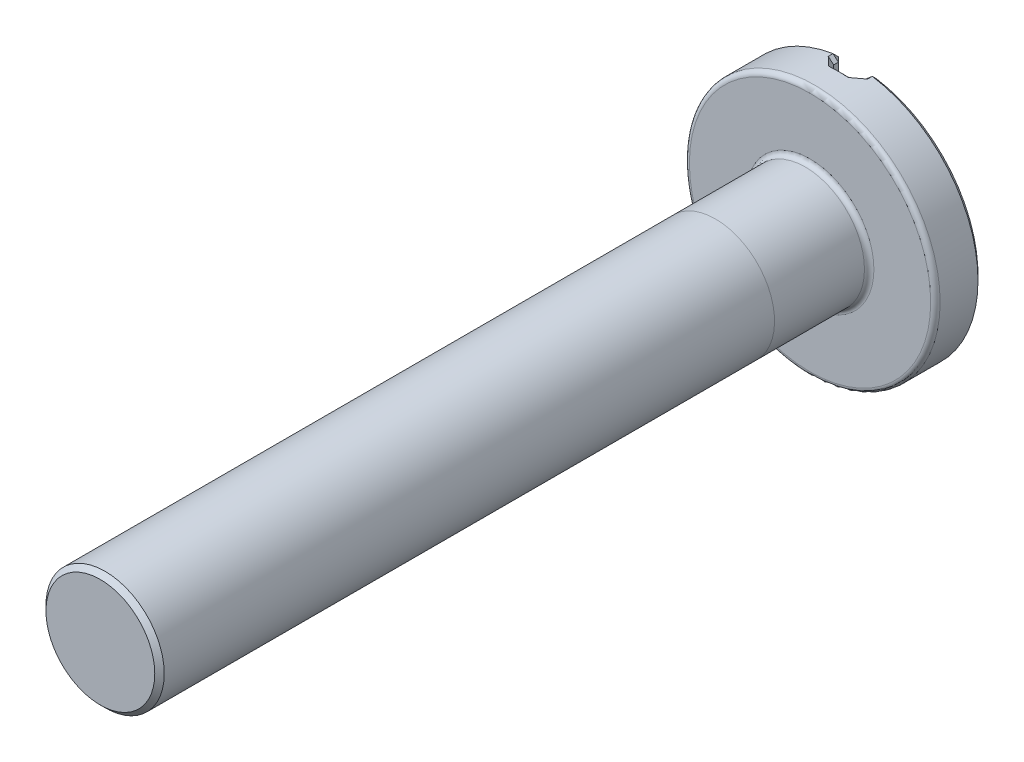
ISO-10303-21;
HEADER;
FILE_DESCRIPTION(('STEP AP214'),'2;1');
FILE_NAME('part.step','',(''),(''),'','','');
FILE_SCHEMA(('AUTOMOTIVE_DESIGN { 1 0 10303 214 1 1 1 1 }'));
ENDSEC;
DATA;
#1=APPLICATION_CONTEXT('core data for automotive mechanical design processes');
#2=APPLICATION_PROTOCOL_DEFINITION('international standard','automotive_design',2000,#1);
#3=PRODUCT_CONTEXT('',#1,'mechanical');
#4=PRODUCT('Part','Part','',(#3));
#5=PRODUCT_RELATED_PRODUCT_CATEGORY('part','',(#4));
#6=PRODUCT_DEFINITION_FORMATION('','',#4);
#7=PRODUCT_DEFINITION_CONTEXT('part definition',#1,'design');
#8=PRODUCT_DEFINITION('design','',#6,#7);
#9=PRODUCT_DEFINITION_SHAPE('','',#8);
#10=(LENGTH_UNIT() NAMED_UNIT(*) SI_UNIT(.MILLI.,.METRE.));
#11=(NAMED_UNIT(*) PLANE_ANGLE_UNIT() SI_UNIT($,.RADIAN.));
#12=(NAMED_UNIT(*) SI_UNIT($,.STERADIAN.) SOLID_ANGLE_UNIT());
#13=UNCERTAINTY_MEASURE_WITH_UNIT(LENGTH_MEASURE(1.E-05),#10,'distance_accuracy_value','');
#14=(GEOMETRIC_REPRESENTATION_CONTEXT(3) GLOBAL_UNCERTAINTY_ASSIGNED_CONTEXT((#13)) GLOBAL_UNIT_ASSIGNED_CONTEXT((#10,
#11,#12)) REPRESENTATION_CONTEXT('',''));
#15=CARTESIAN_POINT('',(0.,0.,0.));
#16=DIRECTION('',(0.,0.,1.));
#17=DIRECTION('',(1.,0.,0.));
#18=AXIS2_PLACEMENT_3D('',#15,#16,#17);
#19=CARTESIAN_POINT('',(0.,0.,7.5));
#20=DIRECTION('',(0.,0.,-1.));
#21=DIRECTION('',(-1.,0.,0.));
#22=AXIS2_PLACEMENT_3D('',#19,#20,#21);
#23=CYLINDRICAL_SURFACE('',#22,0.625);
#24=CARTESIAN_POINT('',(0.,0.,7.45));
#25=DIRECTION('',(0.,0.,1.));
#26=DIRECTION('',(1.,0.,0.));
#27=AXIS2_PLACEMENT_3D('',#24,#25,#26);
#28=CIRCLE('',#27,0.625);
#29=CARTESIAN_POINT('',(0.625,0.,7.45));
#30=VERTEX_POINT('',#29);
#31=EDGE_CURVE('E46',#30,#30,#28,.F.);
#32=ORIENTED_EDGE('',*,*,#31,.T.);
#33=EDGE_LOOP('',(#32));
#34=FACE_BOUND('',#33,.T.);
#35=CARTESIAN_POINT('',(0.,0.,0.999999999999998));
#36=DIRECTION('',(0.,0.,-1.));
#37=DIRECTION('',(0.,1.,0.));
#38=AXIS2_PLACEMENT_3D('',#35,#36,#37);
#39=CIRCLE('',#38,0.625);
#40=CARTESIAN_POINT('',(0.,0.625,0.999999999999998));
#41=VERTEX_POINT('',#40);
#42=EDGE_CURVE('E11',#41,#41,#39,.T.);
#43=ORIENTED_EDGE('',*,*,#42,.F.);
#44=EDGE_LOOP('',(#43));
#45=FACE_BOUND('',#44,.T.);
#46=ADVANCED_FACE('F37',(#34,#45),#23,.T.);
#47=CARTESIAN_POINT('',(0.,0.,-0.5));
#48=DIRECTION('',(0.,0.,1.));
#49=DIRECTION('',(1.,0.,0.));
#50=AXIS2_PLACEMENT_3D('',#47,#48,#49);
#51=CYLINDRICAL_SURFACE('',#50,1.325);
#52=CARTESIAN_POINT('',(0.,0.,-0.05));
#53=DIRECTION('',(0.,0.,1.));
#54=DIRECTION('',(1.,0.,0.));
#55=AXIS2_PLACEMENT_3D('',#52,#53,#54);
#56=CIRCLE('',#55,1.325);
#57=CARTESIAN_POINT('',(1.325,0.,-0.05));
#58=VERTEX_POINT('',#57);
#59=EDGE_CURVE('E461',#58,#58,#56,.F.);
#60=ORIENTED_EDGE('',*,*,#59,.T.);
#61=EDGE_LOOP('',(#60));
#62=FACE_BOUND('',#61,.T.);
#63=CARTESIAN_POINT('',(-0.207843137254902,1.30859704657165,-0.400000000000001));
#64=CARTESIAN_POINT('',(-0.198944612952266,1.31001015516288,-0.391083323710144));
#65=CARTESIAN_POINT('',(-0.189997133243153,1.3113383968159,-0.382201765348477));
#66=CARTESIAN_POINT('',(-0.171998203310304,1.31382052719629,-0.364519994761566));
#67=CARTESIAN_POINT('',(-0.162946752754306,1.3149744153663,-0.355719782796444));
#68=CARTESIAN_POINT('',(-0.137386181813814,1.31796203945144,-0.331148582652646));
#69=CARTESIAN_POINT('',(-0.120752529010109,1.31959309958516,-0.315482355604768));
#70=CARTESIAN_POINT('',(-0.10392156862745,1.32091835764895,-0.299999999999999));
#71=B_SPLINE_CURVE_WITH_KNOTS('',3,(#63,#64,#65,#66,#67,#68,#69,#70),.UNSPECIFIED.,.F.,.F.,(4,2,
2,4),(0.,0.0380286734960462,0.07605746855489,0.144770496492938),.UNSPECIFIED.);
#72=CARTESIAN_POINT('',(-0.207843137254902,1.30859704657165,-0.400000000000001));
#73=VERTEX_POINT('',#72);
#74=CARTESIAN_POINT('',(-0.10392156862745,1.32091835764895,-0.299999999999999));
#75=VERTEX_POINT('',#74);
#76=EDGE_CURVE('E250',#73,#75,#71,.T.);
#77=ORIENTED_EDGE('',*,*,#76,.F.);
#78=DIRECTION('',(0.,0.,1.));
#79=VECTOR('',#78,1.);
#80=CARTESIAN_POINT('',(-0.207843137254902,1.30859704657165,-0.5));
#81=LINE('',#80,#79);
#82=CARTESIAN_POINT('',(-0.207843137254902,1.30859704657165,-0.45));
#83=VERTEX_POINT('',#82);
#84=EDGE_CURVE('E248',#73,#83,#81,.F.);
#85=ORIENTED_EDGE('',*,*,#84,.T.);
#86=CARTESIAN_POINT('',(0.,0.,-0.45));
#87=DIRECTION('',(0.,0.,1.));
#88=DIRECTION('',(1.,0.,0.));
#89=AXIS2_PLACEMENT_3D('',#86,#87,#88);
#90=CIRCLE('',#89,1.325);
#91=CARTESIAN_POINT('',(-0.207843137254903,-1.30859704657165,-0.45));
#92=VERTEX_POINT('',#91);
#93=EDGE_CURVE('E243',#83,#92,#90,.T.);
#94=ORIENTED_EDGE('',*,*,#93,.T.);
#95=DIRECTION('',(0.,0.,1.));
#96=VECTOR('',#95,1.);
#97=CARTESIAN_POINT('',(-0.207843137254903,-1.30859704657165,-0.5));
#98=LINE('',#97,#96);
#99=CARTESIAN_POINT('',(-0.207843137254903,-1.30859704657165,-0.400000000000001));
#100=VERTEX_POINT('',#99);
#101=EDGE_CURVE('E241',#92,#100,#98,.T.);
#102=ORIENTED_EDGE('',*,*,#101,.T.);
#103=CARTESIAN_POINT('',(-0.103921568627451,-1.32091835764895,-0.299999999999999));
#104=CARTESIAN_POINT('',(-0.113236467272082,-1.32018526767909,-0.308567275963699));
#105=CARTESIAN_POINT('',(-0.122490767260579,-1.31935825110937,-0.317191695644924));
#106=CARTESIAN_POINT('',(-0.140884473864295,-1.31752124601971,-0.334542919242578));
#107=CARTESIAN_POINT('',(-0.150023881068516,-1.3165112584382,-0.343269722633687));
#108=CARTESIAN_POINT('',(-0.17552459729029,-1.31342642300711,-0.367891690895517));
#109=CARTESIAN_POINT('',(-0.191763051988927,-1.31114990369224,-0.383889412681227));
#110=CARTESIAN_POINT('',(-0.207843137254903,-1.30859704657165,-0.400000000000001));
#111=B_SPLINE_CURVE_WITH_KNOTS('',3,(#103,#104,#105,#106,#107,#108,#109,#110),.UNSPECIFIED.,.F.,
.F.,(4,2,2,4),(0.,0.0380291626217552,0.0760581302059462,0.144770913983085),.UNSPECIFIED.);
#112=CARTESIAN_POINT('',(-0.103921568627451,-1.32091835764895,-0.299999999999999));
#113=VERTEX_POINT('',#112);
#114=EDGE_CURVE('E234',#113,#100,#111,.T.);
#115=ORIENTED_EDGE('',*,*,#114,.F.);
#116=CARTESIAN_POINT('',(0.,0.,-0.299999999999999));
#117=DIRECTION('',(0.,0.,-1.));
#118=DIRECTION('',(-1.,0.,0.));
#119=AXIS2_PLACEMENT_3D('',#116,#117,#118);
#120=CIRCLE('',#119,1.325);
#121=CARTESIAN_POINT('',(0.10392156862745,-1.32091835764895,-0.299999999999999));
#122=VERTEX_POINT('',#121);
#123=EDGE_CURVE('E197',#113,#122,#120,.F.);
#124=ORIENTED_EDGE('',*,*,#123,.T.);
#125=CARTESIAN_POINT('',(0.207843137254902,-1.30859704657165,-0.400000000000001));
#126=CARTESIAN_POINT('',(0.198944612952266,-1.31001015516288,-0.391083323710144));
#127=CARTESIAN_POINT('',(0.189997133243153,-1.3113383968159,-0.382201765348477));
#128=CARTESIAN_POINT('',(0.171998203310304,-1.31382052719629,-0.364519994761565));
#129=CARTESIAN_POINT('',(0.162946752754306,-1.3149744153663,-0.355719782796444));
#130=CARTESIAN_POINT('',(0.137386181813814,-1.31796203945144,-0.331148582652646));
#131=CARTESIAN_POINT('',(0.120752529010109,-1.31959309958516,-0.315482355604768));
#132=CARTESIAN_POINT('',(0.10392156862745,-1.32091835764895,-0.299999999999999));
#133=B_SPLINE_CURVE_WITH_KNOTS('',3,(#125,#126,#127,#128,#129,#130,#131,#132),.UNSPECIFIED.,.F.,
.F.,(4,2,2,4),(0.,0.0380286734960462,0.07605746855489,0.144770496492938),.UNSPECIFIED.);
#134=CARTESIAN_POINT('',(0.207843137254902,-1.30859704657165,-0.400000000000001));
#135=VERTEX_POINT('',#134);
#136=EDGE_CURVE('E188',#135,#122,#133,.T.);
#137=ORIENTED_EDGE('',*,*,#136,.F.);
#138=DIRECTION('',(0.,0.,1.));
#139=VECTOR('',#138,1.);
#140=CARTESIAN_POINT('',(0.207843137254902,-1.30859704657165,-0.5));
#141=LINE('',#140,#139);
#142=CARTESIAN_POINT('',(0.207843137254902,-1.30859704657165,-0.45));
#143=VERTEX_POINT('',#142);
#144=EDGE_CURVE('E186',#135,#143,#141,.F.);
#145=ORIENTED_EDGE('',*,*,#144,.T.);
#146=CARTESIAN_POINT('',(0.,0.,-0.45));
#147=DIRECTION('',(0.,0.,1.));
#148=DIRECTION('',(1.,0.,0.));
#149=AXIS2_PLACEMENT_3D('',#146,#147,#148);
#150=CIRCLE('',#149,1.325);
#151=CARTESIAN_POINT('',(0.207843137254903,1.30859704657165,-0.45));
#152=VERTEX_POINT('',#151);
#153=EDGE_CURVE('E182',#143,#152,#150,.T.);
#154=ORIENTED_EDGE('',*,*,#153,.T.);
#155=DIRECTION('',(0.,0.,1.));
#156=VECTOR('',#155,1.);
#157=CARTESIAN_POINT('',(0.207843137254903,1.30859704657165,-0.5));
#158=LINE('',#157,#156);
#159=CARTESIAN_POINT('',(0.207843137254903,1.30859704657165,-0.400000000000001));
#160=VERTEX_POINT('',#159);
#161=EDGE_CURVE('E184',#152,#160,#158,.T.);
#162=ORIENTED_EDGE('',*,*,#161,.T.);
#163=CARTESIAN_POINT('',(0.103921568627451,1.32091835764895,-0.299999999999999));
#164=CARTESIAN_POINT('',(0.113236467272082,1.32018526767909,-0.308567275963699));
#165=CARTESIAN_POINT('',(0.122490767260579,1.31935825110937,-0.317191695644924));
#166=CARTESIAN_POINT('',(0.140884473864295,1.31752124601971,-0.334542919242578));
#167=CARTESIAN_POINT('',(0.150023881068516,1.3165112584382,-0.343269722633687));
#168=CARTESIAN_POINT('',(0.17552459729029,1.31342642300711,-0.367891690895517));
#169=CARTESIAN_POINT('',(0.191763051988927,1.31114990369224,-0.383889412681227));
#170=CARTESIAN_POINT('',(0.207843137254903,1.30859704657165,-0.400000000000001));
#171=B_SPLINE_CURVE_WITH_KNOTS('',3,(#163,#164,#165,#166,#167,#168,#169,#170),.UNSPECIFIED.,.F.,
.F.,(4,2,2,4),(0.,0.0380291626217552,0.0760581302059462,0.144770913983085),.UNSPECIFIED.);
#172=CARTESIAN_POINT('',(0.103921568627451,1.32091835764895,-0.299999999999999));
#173=VERTEX_POINT('',#172);
#174=EDGE_CURVE('E227',#173,#160,#171,.T.);
#175=ORIENTED_EDGE('',*,*,#174,.F.);
#176=CARTESIAN_POINT('',(0.,0.,-0.299999999999999));
#177=DIRECTION('',(0.,0.,-1.));
#178=DIRECTION('',(-1.,0.,0.));
#179=AXIS2_PLACEMENT_3D('',#176,#177,#178);
#180=CIRCLE('',#179,1.325);
#181=EDGE_CURVE('E246',#173,#75,#180,.F.);
#182=ORIENTED_EDGE('',*,*,#181,.T.);
#183=EDGE_LOOP('',(#77,#85,#94,#102,#115,#124,#137,#145,#154,#162,#175,#182));
#184=FACE_BOUND('',#183,.T.);
#185=ADVANCED_FACE('F199',(#62,#184),#51,.T.);
#186=CARTESIAN_POINT('',(0.,0.,-0.5));
#187=DIRECTION('',(0.,0.,1.));
#188=DIRECTION('',(1.,0.,0.));
#189=AXIS2_PLACEMENT_3D('',#186,#187,#188);
#190=PLANE('',#189);
#191=CARTESIAN_POINT('',(0.,0.,-0.5));
#192=DIRECTION('',(0.,0.,1.));
#193=DIRECTION('',(1.,0.,0.));
#194=AXIS2_PLACEMENT_3D('',#191,#192,#193);
#195=CIRCLE('',#194,1.275);
#196=CARTESIAN_POINT('',(-0.2,-1.2592160259463,-0.5));
#197=VERTEX_POINT('',#196);
#198=CARTESIAN_POINT('',(-0.2,1.2592160259463,-0.5));
#199=VERTEX_POINT('',#198);
#200=EDGE_CURVE('E165',#197,#199,#195,.F.);
#201=ORIENTED_EDGE('',*,*,#200,.T.);
#202=DIRECTION('',(0.,-1.,0.));
#203=VECTOR('',#202,1.);
#204=CARTESIAN_POINT('',(-0.2,0.,-0.5));
#205=LINE('',#204,#203);
#206=EDGE_CURVE('E147',#199,#197,#205,.T.);
#207=ORIENTED_EDGE('',*,*,#206,.T.);
#208=EDGE_LOOP('',(#201,#207));
#209=FACE_BOUND('',#208,.T.);
#210=ADVANCED_FACE('F172',(#209),#190,.F.);
#211=ORIENTED_EDGE('',*,*,#42,.T.);
#212=EDGE_LOOP('',(#211));
#213=FACE_BOUND('',#212,.T.);
#214=CARTESIAN_POINT('',(0.,0.,0.0499999999999997));
#215=DIRECTION('',(0.,0.,1.));
#216=DIRECTION('',(1.,0.,0.));
#217=AXIS2_PLACEMENT_3D('',#214,#215,#216);
#218=CIRCLE('',#217,0.625);
#219=CARTESIAN_POINT('',(0.625,0.,0.0499999999999997));
#220=VERTEX_POINT('',#219);
#221=EDGE_CURVE('E459',#220,#220,#218,.T.);
#222=ORIENTED_EDGE('',*,*,#221,.T.);
#223=EDGE_LOOP('',(#222));
#224=FACE_BOUND('',#223,.T.);
#225=ADVANCED_FACE('F208',(#213,#224),#23,.T.);
#226=CARTESIAN_POINT('',(0.,0.,7.5));
#227=DIRECTION('',(0.,0.,1.));
#228=DIRECTION('',(1.,0.,0.));
#229=AXIS2_PLACEMENT_3D('',#226,#227,#228);
#230=PLANE('',#229);
#231=CARTESIAN_POINT('',(0.,0.,7.5));
#232=DIRECTION('',(0.,0.,1.));
#233=DIRECTION('',(1.,0.,0.));
#234=AXIS2_PLACEMENT_3D('',#231,#232,#233);
#235=CIRCLE('',#234,0.574999999999998);
#236=CARTESIAN_POINT('',(0.574999999999998,0.,7.5));
#237=VERTEX_POINT('',#236);
#238=EDGE_CURVE('E460',#237,#237,#235,.T.);
#239=ORIENTED_EDGE('',*,*,#238,.T.);
#240=EDGE_LOOP('',(#239));
#241=FACE_BOUND('',#240,.T.);
#242=ADVANCED_FACE('F446',(#241),#230,.T.);
#243=CARTESIAN_POINT('',(0.,0.,-0.5));
#244=DIRECTION('',(0.,0.,1.));
#245=DIRECTION('',(1.,0.,0.));
#246=AXIS2_PLACEMENT_3D('',#243,#244,#245);
#247=CIRCLE('',#246,1.275);
#248=CARTESIAN_POINT('',(0.2,1.2592160259463,-0.5));
#249=VERTEX_POINT('',#248);
#250=CARTESIAN_POINT('',(0.2,-1.2592160259463,-0.5));
#251=VERTEX_POINT('',#250);
#252=EDGE_CURVE('E52',#249,#251,#247,.F.);
#253=ORIENTED_EDGE('',*,*,#252,.T.);
#254=DIRECTION('',(0.,1.,0.));
#255=VECTOR('',#254,1.);
#256=CARTESIAN_POINT('',(0.2,0.,-0.5));
#257=LINE('',#256,#255);
#258=EDGE_CURVE('E477',#251,#249,#257,.T.);
#259=ORIENTED_EDGE('',*,*,#258,.T.);
#260=EDGE_LOOP('',(#253,#259));
#261=FACE_BOUND('',#260,.T.);
#262=ADVANCED_FACE('F452',(#261),#190,.F.);
#263=CARTESIAN_POINT('',(0.,0.,0.));
#264=DIRECTION('',(0.,0.,1.));
#265=DIRECTION('',(1.,0.,0.));
#266=AXIS2_PLACEMENT_3D('',#263,#264,#265);
#267=PLANE('',#266);
#268=CARTESIAN_POINT('',(0.,0.,0.));
#269=DIRECTION('',(0.,0.,1.));
#270=DIRECTION('',(1.,0.,0.));
#271=AXIS2_PLACEMENT_3D('',#268,#269,#270);
#272=CIRCLE('',#271,1.275);
#273=CARTESIAN_POINT('',(1.275,0.,0.));
#274=VERTEX_POINT('',#273);
#275=EDGE_CURVE('E466',#274,#274,#272,.T.);
#276=ORIENTED_EDGE('',*,*,#275,.T.);
#277=EDGE_LOOP('',(#276));
#278=FACE_BOUND('',#277,.T.);
#279=CARTESIAN_POINT('',(0.,0.,0.));
#280=DIRECTION('',(0.,0.,1.));
#281=DIRECTION('',(1.,0.,0.));
#282=AXIS2_PLACEMENT_3D('',#279,#280,#281);
#283=CIRCLE('',#282,0.675);
#284=CARTESIAN_POINT('',(0.675,0.,0.));
#285=VERTEX_POINT('',#284);
#286=EDGE_CURVE('E474',#285,#285,#283,.F.);
#287=ORIENTED_EDGE('',*,*,#286,.T.);
#288=EDGE_LOOP('',(#287));
#289=FACE_BOUND('',#288,.T.);
#290=ADVANCED_FACE('F604',(#278,#289),#267,.T.);
#291=CARTESIAN_POINT('',(-0.149999999999999,11.0409396780184,-0.35));
#292=DIRECTION('',(-1.,0.,0.));
#293=DIRECTION('',(0.,-1.,0.));
#294=AXIS2_PLACEMENT_3D('',#291,#292,#293);
#295=PLANE('',#294);
#296=DIRECTION('',(0.,0.,-1.));
#297=VECTOR('',#296,1.);
#298=CARTESIAN_POINT('',(-0.15,-1.2592160259463,-0.5));
#299=LINE('',#298,#297);
#300=CARTESIAN_POINT('',(-0.15,-1.2592160259463,-0.400000000000001));
#301=VERTEX_POINT('',#300);
#302=CARTESIAN_POINT('',(-0.15,-1.2592160259463,-0.45));
#303=VERTEX_POINT('',#302);
#304=EDGE_CURVE('E179',#301,#303,#299,.T.);
#305=ORIENTED_EDGE('',*,*,#304,.T.);
#306=DIRECTION('',(0.,1.,0.));
#307=VECTOR('',#306,1.);
#308=CARTESIAN_POINT('',(-0.149999999999999,11.0409396780184,-0.45));
#309=LINE('',#308,#307);
#310=CARTESIAN_POINT('',(-0.15,1.2592160259463,-0.45));
#311=VERTEX_POINT('',#310);
#312=EDGE_CURVE('E149',#303,#311,#309,.T.);
#313=ORIENTED_EDGE('',*,*,#312,.T.);
#314=DIRECTION('',(0.,0.,1.));
#315=VECTOR('',#314,1.);
#316=CARTESIAN_POINT('',(-0.15,1.2592160259463,-0.35));
#317=LINE('',#316,#315);
#318=CARTESIAN_POINT('',(-0.15,1.2592160259463,-0.400000000000001));
#319=VERTEX_POINT('',#318);
#320=EDGE_CURVE('E175',#311,#319,#317,.T.);
#321=ORIENTED_EDGE('',*,*,#320,.T.);
#322=DIRECTION('',(0.,-1.,0.));
#323=VECTOR('',#322,1.);
#324=CARTESIAN_POINT('',(-0.149999999999999,11.0409396780184,-0.400000000000001));
#325=LINE('',#324,#323);
#326=EDGE_CURVE('E173',#319,#301,#325,.T.);
#327=ORIENTED_EDGE('',*,*,#326,.T.);
#328=EDGE_LOOP('',(#305,#313,#321,#327));
#329=FACE_BOUND('',#328,.T.);
#330=ADVANCED_FACE('F560',(#329),#295,.F.);
#331=CARTESIAN_POINT('',(0.150000000000001,11.0409396780184,-0.35));
#332=DIRECTION('',(1.,0.,0.));
#333=DIRECTION('',(0.,1.,0.));
#334=AXIS2_PLACEMENT_3D('',#331,#332,#333);
#335=PLANE('',#334);
#336=DIRECTION('',(0.,0.,1.));
#337=VECTOR('',#336,1.);
#338=CARTESIAN_POINT('',(0.15,-1.2592160259463,-0.35));
#339=LINE('',#338,#337);
#340=CARTESIAN_POINT('',(0.15,-1.2592160259463,-0.45));
#341=VERTEX_POINT('',#340);
#342=CARTESIAN_POINT('',(0.15,-1.2592160259463,-0.400000000000001));
#343=VERTEX_POINT('',#342);
#344=EDGE_CURVE('E496',#341,#343,#339,.T.);
#345=ORIENTED_EDGE('',*,*,#344,.T.);
#346=DIRECTION('',(0.,1.,0.));
#347=VECTOR('',#346,1.);
#348=CARTESIAN_POINT('',(0.150000000000001,11.0409396780184,-0.400000000000001));
#349=LINE('',#348,#347);
#350=CARTESIAN_POINT('',(0.15,1.2592160259463,-0.400000000000001));
#351=VERTEX_POINT('',#350);
#352=EDGE_CURVE('E525',#343,#351,#349,.T.);
#353=ORIENTED_EDGE('',*,*,#352,.T.);
#354=DIRECTION('',(0.,0.,-1.));
#355=VECTOR('',#354,1.);
#356=CARTESIAN_POINT('',(0.15,1.2592160259463,-0.5));
#357=LINE('',#356,#355);
#358=CARTESIAN_POINT('',(0.15,1.2592160259463,-0.45));
#359=VERTEX_POINT('',#358);
#360=EDGE_CURVE('E520',#351,#359,#357,.T.);
#361=ORIENTED_EDGE('',*,*,#360,.T.);
#362=DIRECTION('',(0.,-1.,0.));
#363=VECTOR('',#362,1.);
#364=CARTESIAN_POINT('',(0.150000000000001,11.0409396780184,-0.45));
#365=LINE('',#364,#363);
#366=EDGE_CURVE('E257',#359,#341,#365,.T.);
#367=ORIENTED_EDGE('',*,*,#366,.T.);
#368=EDGE_LOOP('',(#345,#353,#361,#367));
#369=FACE_BOUND('',#368,.T.);
#370=ADVANCED_FACE('F660',(#369),#335,.F.);
#371=CARTESIAN_POINT('',(0.,0.,-0.35));
#372=DIRECTION('',(0.,0.,-1.));
#373=DIRECTION('',(-1.,0.,0.));
#374=AXIS2_PLACEMENT_3D('',#371,#372,#373);
#375=PLANE('',#374);
#376=DIRECTION('',(0.,-1.,0.));
#377=VECTOR('',#376,1.);
#378=CARTESIAN_POINT('',(0.0999999999999995,0.,-0.35));
#379=LINE('',#378,#377);
#380=CARTESIAN_POINT('',(0.0999999999999996,1.27107238188862,-0.35));
#381=VERTEX_POINT('',#380);
#382=CARTESIAN_POINT('',(0.0999999999999993,-1.27107238188862,-0.35));
#383=VERTEX_POINT('',#382);
#384=EDGE_CURVE('E526',#381,#383,#379,.T.);
#385=ORIENTED_EDGE('',*,*,#384,.T.);
#386=CARTESIAN_POINT('',(0.,0.,-0.35));
#387=DIRECTION('',(0.,0.,-1.));
#388=DIRECTION('',(-1.,0.,0.));
#389=AXIS2_PLACEMENT_3D('',#386,#387,#388);
#390=CIRCLE('',#389,1.275);
#391=CARTESIAN_POINT('',(-0.0999999999999995,-1.27107238188862,-0.35));
#392=VERTEX_POINT('',#391);
#393=EDGE_CURVE('E511',#383,#392,#390,.T.);
#394=ORIENTED_EDGE('',*,*,#393,.T.);
#395=DIRECTION('',(0.,1.,0.));
#396=VECTOR('',#395,1.);
#397=CARTESIAN_POINT('',(-0.0999999999999994,0.,-0.35));
#398=LINE('',#397,#396);
#399=CARTESIAN_POINT('',(-0.0999999999999992,1.27107238188862,-0.35));
#400=VERTEX_POINT('',#399);
#401=EDGE_CURVE('E531',#392,#400,#398,.T.);
#402=ORIENTED_EDGE('',*,*,#401,.T.);
#403=CARTESIAN_POINT('',(0.,0.,-0.35));
#404=DIRECTION('',(0.,0.,-1.));
#405=DIRECTION('',(-1.,0.,0.));
#406=AXIS2_PLACEMENT_3D('',#403,#404,#405);
#407=CIRCLE('',#406,1.275);
#408=EDGE_CURVE('E528',#400,#381,#407,.T.);
#409=ORIENTED_EDGE('',*,*,#408,.T.);
#410=EDGE_LOOP('',(#385,#394,#402,#409));
#411=FACE_BOUND('',#410,.T.);
#412=ADVANCED_FACE('F424',(#411),#375,.T.);
#413=CARTESIAN_POINT('',(0.,0.,-0.45));
#414=DIRECTION('',(0.,0.,1.));
#415=DIRECTION('',(1.,0.,0.));
#416=AXIS2_PLACEMENT_3D('',#413,#414,#415);
#417=CONICAL_SURFACE('',#416,1.325,0.785398163397448);
#418=DIRECTION('',(0.110918710774371,-0.698353090921885,0.707106781186548));
#419=VECTOR('',#418,1.);
#420=CARTESIAN_POINT('',(0.,0.,-1.77500000000001));
#421=LINE('',#420,#419);
#422=EDGE_CURVE('E480',#251,#143,#421,.T.);
#423=ORIENTED_EDGE('',*,*,#422,.F.);
#424=ORIENTED_EDGE('',*,*,#252,.F.);
#425=DIRECTION('',(-0.110918710774371,-0.698353090921885,-0.707106781186548));
#426=VECTOR('',#425,1.);
#427=CARTESIAN_POINT('',(0.,0.,-1.77500000000001));
#428=LINE('',#427,#426);
#429=EDGE_CURVE('E60',#152,#249,#428,.T.);
#430=ORIENTED_EDGE('',*,*,#429,.F.);
#431=ORIENTED_EDGE('',*,*,#153,.F.);
#432=EDGE_LOOP('',(#423,#424,#430,#431));
#433=FACE_BOUND('',#432,.T.);
#434=ADVANCED_FACE('F420',(#433),#417,.T.);
#435=CARTESIAN_POINT('',(0.2,0.,-0.5));
#436=DIRECTION('',(0.707106781186547,0.,0.707106781186547));
#437=DIRECTION('',(0.,1.,0.));
#438=AXIS2_PLACEMENT_3D('',#435,#436,#437);
#439=PLANE('',#438);
#440=DIRECTION('',(0.707106781186547,0.,-0.707106781186547));
#441=VECTOR('',#440,1.);
#442=CARTESIAN_POINT('',(0.15,1.2592160259463,-0.45));
#443=LINE('',#442,#441);
#444=EDGE_CURVE('E170',#249,#359,#443,.F.);
#445=ORIENTED_EDGE('',*,*,#444,.F.);
#446=ORIENTED_EDGE('',*,*,#258,.F.);
#447=DIRECTION('',(-0.707106781186547,0.,0.707106781186547));
#448=VECTOR('',#447,1.);
#449=CARTESIAN_POINT('',(0.178921568627452,-1.2592160259463,-0.478921568627452));
#450=LINE('',#449,#448);
#451=EDGE_CURVE('E483',#341,#251,#450,.F.);
#452=ORIENTED_EDGE('',*,*,#451,.F.);
#453=ORIENTED_EDGE('',*,*,#366,.F.);
#454=EDGE_LOOP('',(#445,#446,#452,#453));
#455=FACE_BOUND('',#454,.T.);
#456=ADVANCED_FACE('F417',(#455),#439,.F.);
#457=CARTESIAN_POINT('',(0.15,1.2592160259463,-0.45));
#458=DIRECTION('',(-0.544565628862064,0.637884434458266,-0.544565628862053));
#459=DIRECTION('',(-0.760546758949783,-0.649283164305822,0.));
#460=AXIS2_PLACEMENT_3D('',#457,#458,#459);
#461=PLANE('',#460);
#462=ORIENTED_EDGE('',*,*,#429,.T.);
#463=ORIENTED_EDGE('',*,*,#444,.T.);
#464=DIRECTION('',(0.760546758949783,0.649283164305822,0.));
#465=VECTOR('',#464,1.);
#466=CARTESIAN_POINT('',(0.15,1.2592160259463,-0.45));
#467=LINE('',#466,#465);
#468=EDGE_CURVE('E485',#152,#359,#467,.F.);
#469=ORIENTED_EDGE('',*,*,#468,.F.);
#470=EDGE_LOOP('',(#462,#463,#469));
#471=FACE_BOUND('',#470,.T.);
#472=ADVANCED_FACE('F413',(#471),#461,.T.);
#473=CARTESIAN_POINT('',(0.207843137254902,-1.30859704657165,-0.45));
#474=DIRECTION('',(-0.544565628862064,-0.637884434458266,-0.544565628862053));
#475=DIRECTION('',(0.760546758949783,-0.649283164305822,0.));
#476=AXIS2_PLACEMENT_3D('',#473,#474,#475);
#477=PLANE('',#476);
#478=ORIENTED_EDGE('',*,*,#451,.T.);
#479=ORIENTED_EDGE('',*,*,#422,.T.);
#480=DIRECTION('',(0.760546758949783,-0.649283164305822,0.));
#481=VECTOR('',#480,1.);
#482=CARTESIAN_POINT('',(0.207843137254902,-1.30859704657165,-0.45));
#483=LINE('',#482,#481);
#484=EDGE_CURVE('E379',#341,#143,#483,.T.);
#485=ORIENTED_EDGE('',*,*,#484,.F.);
#486=EDGE_LOOP('',(#478,#479,#485));
#487=FACE_BOUND('',#486,.T.);
#488=ADVANCED_FACE('F409',(#487),#477,.T.);
#489=CARTESIAN_POINT('',(0.15,1.2592160259463,-0.5));
#490=DIRECTION('',(-0.649283164305822,0.760546758949783,0.));
#491=DIRECTION('',(0.,0.,1.));
#492=AXIS2_PLACEMENT_3D('',#489,#490,#491);
#493=PLANE('',#492);
#494=ORIENTED_EDGE('',*,*,#468,.T.);
#495=ORIENTED_EDGE('',*,*,#360,.F.);
#496=DIRECTION('',(-0.760546758949783,-0.649283164305822,0.));
#497=VECTOR('',#496,1.);
#498=CARTESIAN_POINT('',(0.207843137254903,1.30859704657165,-0.400000000000001));
#499=LINE('',#498,#497);
#500=EDGE_CURVE('E380',#160,#351,#499,.T.);
#501=ORIENTED_EDGE('',*,*,#500,.F.);
#502=ORIENTED_EDGE('',*,*,#161,.F.);
#503=EDGE_LOOP('',(#494,#495,#501,#502));
#504=FACE_BOUND('',#503,.T.);
#505=ADVANCED_FACE('F405',(#504),#493,.T.);
#506=CARTESIAN_POINT('',(0.15,-1.2592160259463,-0.5));
#507=DIRECTION('',(0.649283164305822,0.760546758949783,0.));
#508=DIRECTION('',(0.,0.,1.));
#509=AXIS2_PLACEMENT_3D('',#506,#507,#508);
#510=PLANE('',#509);
#511=ORIENTED_EDGE('',*,*,#484,.T.);
#512=ORIENTED_EDGE('',*,*,#144,.F.);
#513=DIRECTION('',(0.760546758949783,-0.649283164305822,0.));
#514=VECTOR('',#513,1.);
#515=CARTESIAN_POINT('',(0.15,-1.2592160259463,-0.400000000000001));
#516=LINE('',#515,#514);
#517=EDGE_CURVE('E507',#343,#135,#516,.T.);
#518=ORIENTED_EDGE('',*,*,#517,.F.);
#519=ORIENTED_EDGE('',*,*,#344,.F.);
#520=EDGE_LOOP('',(#511,#512,#518,#519));
#521=FACE_BOUND('',#520,.T.);
#522=ADVANCED_FACE('F355',(#521),#510,.F.);
#523=CARTESIAN_POINT('',(0.0999999999999995,0.,-0.35));
#524=DIRECTION('',(0.707106781186547,0.,0.707106781186547));
#525=DIRECTION('',(0.,-1.,0.));
#526=AXIS2_PLACEMENT_3D('',#523,#524,#525);
#527=PLANE('',#526);
#528=CARTESIAN_POINT('',(0.15,1.2592160259463,-0.400000000000001));
#529=CARTESIAN_POINT('',(0.145580136008863,1.26026409556021,-0.395580136008863));
#530=CARTESIAN_POINT('',(0.141160272017726,1.26131216517412,-0.391160272017726));
#531=CARTESIAN_POINT('',(0.132320544035451,1.26340830440195,-0.382320544035452));
#532=CARTESIAN_POINT('',(0.127900680044314,1.26445637401586,-0.377900680044315));
#533=CARTESIAN_POINT('',(0.115653877368785,1.26736042304938,-0.365653877368785));
#534=CARTESIAN_POINT('',(0.107826938684392,1.269216402469,-0.357826938684393));
#535=CARTESIAN_POINT('',(0.0999999999999996,1.27107238188862,-0.35));
#536=B_SPLINE_CURVE_WITH_KNOTS('',3,(#528,#529,#530,#531,#532,#533,#534,#535),.UNSPECIFIED.,.F.,
.F.,(4,2,2,4),(0.,0.0190136689737448,0.0380273379474896,0.0716977905951846),.UNSPECIFIED.);
#537=EDGE_CURVE('E370',#351,#381,#536,.T.);
#538=ORIENTED_EDGE('',*,*,#537,.F.);
#539=ORIENTED_EDGE('',*,*,#352,.F.);
#540=CARTESIAN_POINT('',(0.0999999999999993,-1.27107238188862,-0.35));
#541=CARTESIAN_POINT('',(0.104419863991136,-1.2700243122747,-0.354419863991137));
#542=CARTESIAN_POINT('',(0.108839727982274,-1.26897624266079,-0.358839727982274));
#543=CARTESIAN_POINT('',(0.117679455964548,-1.26688010343297,-0.367679455964549));
#544=CARTESIAN_POINT('',(0.122099319955685,-1.26583203381906,-0.372099319955686));
#545=CARTESIAN_POINT('',(0.134346122631215,-1.26292798478553,-0.384346122631216));
#546=CARTESIAN_POINT('',(0.142173061315607,-1.26107200536592,-0.392173061315608));
#547=CARTESIAN_POINT('',(0.15,-1.2592160259463,-0.400000000000001));
#548=B_SPLINE_CURVE_WITH_KNOTS('',3,(#540,#541,#542,#543,#544,#545,#546,#547),.UNSPECIFIED.,.F.,
.F.,(4,2,2,4),(0.,0.0190136689737448,0.0380273379474896,0.0716977905951846),.UNSPECIFIED.);
#549=EDGE_CURVE('E363',#383,#343,#548,.T.);
#550=ORIENTED_EDGE('',*,*,#549,.F.);
#551=ORIENTED_EDGE('',*,*,#384,.F.);
#552=EDGE_LOOP('',(#538,#539,#550,#551));
#553=FACE_BOUND('',#552,.T.);
#554=ADVANCED_FACE('F350',(#553),#527,.F.);
#555=CARTESIAN_POINT('',(0.0999999999999996,1.27107238188862,-0.35));
#556=CARTESIAN_POINT('',(0.15,1.2592160259463,-0.400000000000001));
#557=CARTESIAN_POINT('',(0.103921568627451,1.32091835764895,-0.299999999999999));
#558=CARTESIAN_POINT('',(0.207843137254903,1.30859704657165,-0.400000000000001));
#559=CARTESIAN_POINT('',(0.104024025887026,1.32222066357865,-0.29869366994042));
#560=CARTESIAN_POINT('',(0.209354381833633,1.30988720480396,-0.400000000000001));
#561=B_SPLINE_SURFACE_WITH_KNOTS('',1,1,((#555,#556),(#557,#558),(#559,#560)),.UNSPECIFIED.,.F.,
.F.,.F.,(2,1,2),(2,2),(0.,1.,1.0261266011916),(0.,1.),.UNSPECIFIED.);
#562=DIRECTION('',(0.0554593553871801,0.704928549499903,0.707106781186548));
#563=VECTOR('',#562,1.);
#564=CARTESIAN_POINT('',(0.0999999999999996,1.27107238188862,-0.35));
#565=LINE('',#564,#563);
#566=EDGE_CURVE('E512',#173,#381,#565,.F.);
#567=ORIENTED_EDGE('',*,*,#500,.T.);
#568=ORIENTED_EDGE('',*,*,#537,.T.);
#569=ORIENTED_EDGE('',*,*,#566,.F.);
#570=ORIENTED_EDGE('',*,*,#174,.T.);
#571=EDGE_LOOP('',(#567,#568,#569,#570));
#572=FACE_BOUND('',#571,.T.);
#573=ADVANCED_FACE('F354',(#572),#561,.T.);
#574=CARTESIAN_POINT('',(0.15,-1.2592160259463,-0.400000000000001));
#575=CARTESIAN_POINT('',(0.0999999999999993,-1.27107238188862,-0.35));
#576=CARTESIAN_POINT('',(0.207843137254902,-1.30859704657165,-0.400000000000001));
#577=CARTESIAN_POINT('',(0.10392156862745,-1.32091835764895,-0.299999999999999));
#578=CARTESIAN_POINT('',(0.209333861546876,-1.30986968651654,-0.400000000000001));
#579=CARTESIAN_POINT('',(0.104022634681143,-1.32220298034491,-0.298711407815412));
#580=B_SPLINE_SURFACE_WITH_KNOTS('',1,1,((#574,#575),(#576,#577),(#578,#579)),.UNSPECIFIED.,.F.,
.F.,.F.,(2,1,2),(2,2),(0.,1.,1.02577184369175),(0.,1.),.UNSPECIFIED.);
#581=DIRECTION('',(-0.0554593553871799,0.704928549499903,-0.707106781186548));
#582=VECTOR('',#581,1.);
#583=CARTESIAN_POINT('',(0.10392156862745,-1.32091835764895,-0.299999999999999));
#584=LINE('',#583,#582);
#585=EDGE_CURVE('E318',#383,#122,#584,.F.);
#586=ORIENTED_EDGE('',*,*,#517,.T.);
#587=ORIENTED_EDGE('',*,*,#136,.T.);
#588=ORIENTED_EDGE('',*,*,#585,.F.);
#589=ORIENTED_EDGE('',*,*,#549,.T.);
#590=EDGE_LOOP('',(#586,#587,#588,#589));
#591=FACE_BOUND('',#590,.T.);
#592=ADVANCED_FACE('F348',(#591),#580,.T.);
#593=CARTESIAN_POINT('',(0.,0.,-0.299999999999999));
#594=DIRECTION('',(0.,0.,1.));
#595=DIRECTION('',(1.,0.,0.));
#596=AXIS2_PLACEMENT_3D('',#593,#594,#595);
#597=CONICAL_SURFACE('',#596,1.325,0.785398163397448);
#598=ORIENTED_EDGE('',*,*,#566,.T.);
#599=ORIENTED_EDGE('',*,*,#408,.F.);
#600=DIRECTION('',(0.0554593553871799,-0.704928549499903,-0.707106781186548));
#601=VECTOR('',#600,1.);
#602=CARTESIAN_POINT('',(-0.10392156862745,1.32091835764895,-0.299999999999999));
#603=LINE('',#602,#601);
#604=EDGE_CURVE('E319',#75,#400,#603,.T.);
#605=ORIENTED_EDGE('',*,*,#604,.F.);
#606=ORIENTED_EDGE('',*,*,#181,.F.);
#607=EDGE_LOOP('',(#598,#599,#605,#606));
#608=FACE_BOUND('',#607,.T.);
#609=ADVANCED_FACE('F344',(#608),#597,.T.);
#610=CARTESIAN_POINT('',(0.,0.,-0.299999999999999));
#611=DIRECTION('',(0.,0.,1.));
#612=DIRECTION('',(1.,0.,0.));
#613=AXIS2_PLACEMENT_3D('',#610,#611,#612);
#614=CONICAL_SURFACE('',#613,1.325,0.785398163397448);
#615=ORIENTED_EDGE('',*,*,#585,.T.);
#616=ORIENTED_EDGE('',*,*,#123,.F.);
#617=DIRECTION('',(-0.0554593553871801,-0.704928549499903,0.707106781186548));
#618=VECTOR('',#617,1.);
#619=CARTESIAN_POINT('',(-0.0999999999999996,-1.27107238188862,-0.35));
#620=LINE('',#619,#618);
#621=EDGE_CURVE('E550',#392,#113,#620,.T.);
#622=ORIENTED_EDGE('',*,*,#621,.F.);
#623=ORIENTED_EDGE('',*,*,#393,.F.);
#624=EDGE_LOOP('',(#615,#616,#622,#623));
#625=FACE_BOUND('',#624,.T.);
#626=ADVANCED_FACE('F293',(#625),#614,.T.);
#627=CARTESIAN_POINT('',(-0.0999999999999994,0.,-0.35));
#628=DIRECTION('',(-0.707106781186547,0.,0.707106781186547));
#629=DIRECTION('',(0.,1.,0.));
#630=AXIS2_PLACEMENT_3D('',#627,#628,#629);
#631=PLANE('',#630);
#632=CARTESIAN_POINT('',(-0.0999999999999992,1.27107238188862,-0.35));
#633=CARTESIAN_POINT('',(-0.104419863991136,1.2700243122747,-0.354419863991137));
#634=CARTESIAN_POINT('',(-0.108839727982274,1.26897624266079,-0.358839727982274));
#635=CARTESIAN_POINT('',(-0.117679455964548,1.26688010343297,-0.367679455964549));
#636=CARTESIAN_POINT('',(-0.122099319955685,1.26583203381906,-0.372099319955686));
#637=CARTESIAN_POINT('',(-0.134346122631215,1.26292798478553,-0.384346122631216));
#638=CARTESIAN_POINT('',(-0.142173061315607,1.26107200536592,-0.392173061315608));
#639=CARTESIAN_POINT('',(-0.15,1.2592160259463,-0.400000000000001));
#640=B_SPLINE_CURVE_WITH_KNOTS('',3,(#632,#633,#634,#635,#636,#637,#638,#639),.UNSPECIFIED.,.F.,
.F.,(4,2,2,4),(0.,0.0190136689737448,0.0380273379474896,0.0716977905951846),.UNSPECIFIED.);
#641=EDGE_CURVE('E309',#400,#319,#640,.T.);
#642=ORIENTED_EDGE('',*,*,#641,.F.);
#643=ORIENTED_EDGE('',*,*,#401,.F.);
#644=CARTESIAN_POINT('',(-0.15,-1.2592160259463,-0.400000000000001));
#645=CARTESIAN_POINT('',(-0.145580136008863,-1.26026409556021,-0.395580136008863));
#646=CARTESIAN_POINT('',(-0.141160272017726,-1.26131216517412,-0.391160272017726));
#647=CARTESIAN_POINT('',(-0.132320544035451,-1.26340830440195,-0.382320544035452));
#648=CARTESIAN_POINT('',(-0.127900680044314,-1.26445637401586,-0.377900680044315));
#649=CARTESIAN_POINT('',(-0.115653877368785,-1.26736042304938,-0.365653877368785));
#650=CARTESIAN_POINT('',(-0.107826938684392,-1.269216402469,-0.357826938684393));
#651=CARTESIAN_POINT('',(-0.0999999999999996,-1.27107238188862,-0.35));
#652=B_SPLINE_CURVE_WITH_KNOTS('',3,(#644,#645,#646,#647,#648,#649,#650,#651),.UNSPECIFIED.,.F.,
.F.,(4,2,2,4),(0.,0.0190136689737448,0.0380273379474896,0.0716977905951846),.UNSPECIFIED.);
#653=EDGE_CURVE('E301',#301,#392,#652,.T.);
#654=ORIENTED_EDGE('',*,*,#653,.F.);
#655=ORIENTED_EDGE('',*,*,#326,.F.);
#656=EDGE_LOOP('',(#642,#643,#654,#655));
#657=FACE_BOUND('',#656,.T.);
#658=ADVANCED_FACE('F288',(#657),#631,.F.);
#659=CARTESIAN_POINT('',(-0.15,1.2592160259463,-0.400000000000001));
#660=CARTESIAN_POINT('',(-0.0999999999999992,1.27107238188862,-0.35));
#661=CARTESIAN_POINT('',(-0.207843137254902,1.30859704657165,-0.400000000000001));
#662=CARTESIAN_POINT('',(-0.10392156862745,1.32091835764895,-0.299999999999999));
#663=CARTESIAN_POINT('',(-0.209333861546876,1.30986968651654,-0.400000000000001));
#664=CARTESIAN_POINT('',(-0.104022634681143,1.32220298034491,-0.298711407815412));
#665=B_SPLINE_SURFACE_WITH_KNOTS('',1,1,((#659,#660),(#661,#662),(#663,#664)),.UNSPECIFIED.,.F.,
.F.,.F.,(2,1,2),(2,2),(0.,1.,1.02577184369175),(0.,1.),.UNSPECIFIED.);
#666=DIRECTION('',(-0.760546758949783,0.649283164305822,0.));
#667=VECTOR('',#666,1.);
#668=CARTESIAN_POINT('',(-0.15,1.2592160259463,-0.400000000000001));
#669=LINE('',#668,#667);
#670=EDGE_CURVE('E545',#73,#319,#669,.F.);
#671=ORIENTED_EDGE('',*,*,#604,.T.);
#672=ORIENTED_EDGE('',*,*,#641,.T.);
#673=ORIENTED_EDGE('',*,*,#670,.F.);
#674=ORIENTED_EDGE('',*,*,#76,.T.);
#675=EDGE_LOOP('',(#671,#672,#673,#674));
#676=FACE_BOUND('',#675,.T.);
#677=ADVANCED_FACE('F292',(#676),#665,.T.);
#678=CARTESIAN_POINT('',(-0.0999999999999996,-1.27107238188862,-0.35));
#679=CARTESIAN_POINT('',(-0.15,-1.2592160259463,-0.400000000000001));
#680=CARTESIAN_POINT('',(-0.103921568627451,-1.32091835764895,-0.299999999999999));
#681=CARTESIAN_POINT('',(-0.207843137254903,-1.30859704657165,-0.400000000000001));
#682=CARTESIAN_POINT('',(-0.104024025887025,-1.32222066357865,-0.29869366994042));
#683=CARTESIAN_POINT('',(-0.209354381833633,-1.30988720480396,-0.400000000000001));
#684=B_SPLINE_SURFACE_WITH_KNOTS('',1,1,((#678,#679),(#680,#681),(#682,#683)),.UNSPECIFIED.,.F.,
.F.,.F.,(2,1,2),(2,2),(0.,1.,1.0261266011916),(0.,1.),.UNSPECIFIED.);
#685=DIRECTION('',(0.760546758949783,0.649283164305822,0.));
#686=VECTOR('',#685,1.);
#687=CARTESIAN_POINT('',(-0.207843137254903,-1.30859704657165,-0.400000000000001));
#688=LINE('',#687,#686);
#689=EDGE_CURVE('E543',#301,#100,#688,.F.);
#690=ORIENTED_EDGE('',*,*,#621,.T.);
#691=ORIENTED_EDGE('',*,*,#114,.T.);
#692=ORIENTED_EDGE('',*,*,#689,.F.);
#693=ORIENTED_EDGE('',*,*,#653,.T.);
#694=EDGE_LOOP('',(#690,#691,#692,#693));
#695=FACE_BOUND('',#694,.T.);
#696=ADVANCED_FACE('F286',(#695),#684,.T.);
#697=CARTESIAN_POINT('',(-0.15,1.2592160259463,-0.5));
#698=DIRECTION('',(-0.64928316430582,-0.760546758949784,0.));
#699=DIRECTION('',(0.,0.,1.));
#700=AXIS2_PLACEMENT_3D('',#697,#698,#699);
#701=PLANE('',#700);
#702=ORIENTED_EDGE('',*,*,#670,.T.);
#703=ORIENTED_EDGE('',*,*,#320,.F.);
#704=DIRECTION('',(-0.760546758949784,0.649283164305821,0.));
#705=VECTOR('',#704,1.);
#706=CARTESIAN_POINT('',(-0.15,1.2592160259463,-0.45));
#707=LINE('',#706,#705);
#708=EDGE_CURVE('E540',#83,#311,#707,.F.);
#709=ORIENTED_EDGE('',*,*,#708,.F.);
#710=ORIENTED_EDGE('',*,*,#84,.F.);
#711=EDGE_LOOP('',(#702,#703,#709,#710));
#712=FACE_BOUND('',#711,.T.);
#713=ADVANCED_FACE('F283',(#712),#701,.F.);
#714=CARTESIAN_POINT('',(0.,0.,-0.45));
#715=DIRECTION('',(0.,0.,1.));
#716=DIRECTION('',(1.,0.,0.));
#717=AXIS2_PLACEMENT_3D('',#714,#715,#716);
#718=CONICAL_SURFACE('',#717,1.325,0.785398163397448);
#719=DIRECTION('',(0.110918710774371,0.698353090921885,-0.707106781186548));
#720=VECTOR('',#719,1.);
#721=CARTESIAN_POINT('',(0.,0.,-1.77500000000001));
#722=LINE('',#721,#720);
#723=EDGE_CURVE('E154',#92,#197,#722,.T.);
#724=ORIENTED_EDGE('',*,*,#723,.F.);
#725=ORIENTED_EDGE('',*,*,#93,.F.);
#726=DIRECTION('',(-0.110918710774371,0.698353090921885,0.707106781186548));
#727=VECTOR('',#726,1.);
#728=CARTESIAN_POINT('',(0.,0.,-1.77500000000001));
#729=LINE('',#728,#727);
#730=EDGE_CURVE('E162',#199,#83,#729,.T.);
#731=ORIENTED_EDGE('',*,*,#730,.F.);
#732=ORIENTED_EDGE('',*,*,#200,.F.);
#733=EDGE_LOOP('',(#724,#725,#731,#732));
#734=FACE_BOUND('',#733,.T.);
#735=ADVANCED_FACE('F166',(#734),#718,.T.);
#736=CARTESIAN_POINT('',(-0.15,-1.2592160259463,-0.5));
#737=DIRECTION('',(0.649283164305822,-0.760546758949783,0.));
#738=DIRECTION('',(0.,0.,1.));
#739=AXIS2_PLACEMENT_3D('',#736,#737,#738);
#740=PLANE('',#739);
#741=ORIENTED_EDGE('',*,*,#689,.T.);
#742=ORIENTED_EDGE('',*,*,#101,.F.);
#743=DIRECTION('',(-0.760546758949783,-0.649283164305822,0.));
#744=VECTOR('',#743,1.);
#745=CARTESIAN_POINT('',(-0.178921568627451,-1.28390653625897,-0.45));
#746=LINE('',#745,#744);
#747=EDGE_CURVE('E158',#303,#92,#746,.T.);
#748=ORIENTED_EDGE('',*,*,#747,.F.);
#749=ORIENTED_EDGE('',*,*,#304,.F.);
#750=EDGE_LOOP('',(#741,#742,#748,#749));
#751=FACE_BOUND('',#750,.T.);
#752=ADVANCED_FACE('F276',(#751),#740,.T.);
#753=CARTESIAN_POINT('',(-0.15,1.2592160259463,-0.45));
#754=DIRECTION('',(0.544565628862062,0.637884434458267,-0.544565628862054));
#755=DIRECTION('',(-0.760546758949784,0.64928316430582,0.));
#756=AXIS2_PLACEMENT_3D('',#753,#754,#755);
#757=PLANE('',#756);
#758=ORIENTED_EDGE('',*,*,#730,.T.);
#759=ORIENTED_EDGE('',*,*,#708,.T.);
#760=DIRECTION('',(0.707106781186548,0.,0.707106781186548));
#761=VECTOR('',#760,1.);
#762=CARTESIAN_POINT('',(-0.15,1.2592160259463,-0.45));
#763=LINE('',#762,#761);
#764=EDGE_CURVE('E151',#199,#311,#763,.T.);
#765=ORIENTED_EDGE('',*,*,#764,.F.);
#766=EDGE_LOOP('',(#758,#759,#765));
#767=FACE_BOUND('',#766,.T.);
#768=ADVANCED_FACE('F273',(#767),#757,.T.);
#769=CARTESIAN_POINT('',(-0.2,-1.2592160259463,-0.5));
#770=DIRECTION('',(0.544565628862064,-0.637884434458266,-0.544565628862053));
#771=DIRECTION('',(0.760546758949783,0.649283164305822,0.));
#772=AXIS2_PLACEMENT_3D('',#769,#770,#771);
#773=PLANE('',#772);
#774=ORIENTED_EDGE('',*,*,#747,.T.);
#775=ORIENTED_EDGE('',*,*,#723,.T.);
#776=DIRECTION('',(-0.707106781186547,0.,-0.707106781186547));
#777=VECTOR('',#776,1.);
#778=CARTESIAN_POINT('',(-0.2,-1.2592160259463,-0.5));
#779=LINE('',#778,#777);
#780=EDGE_CURVE('E143',#303,#197,#779,.T.);
#781=ORIENTED_EDGE('',*,*,#780,.F.);
#782=EDGE_LOOP('',(#774,#775,#781));
#783=FACE_BOUND('',#782,.T.);
#784=ADVANCED_FACE('F156',(#783),#773,.T.);
#785=CARTESIAN_POINT('',(-0.2,0.,-0.5));
#786=DIRECTION('',(-0.707106781186547,0.,0.707106781186547));
#787=DIRECTION('',(0.,-1.,0.));
#788=AXIS2_PLACEMENT_3D('',#785,#786,#787);
#789=PLANE('',#788);
#790=ORIENTED_EDGE('',*,*,#764,.T.);
#791=ORIENTED_EDGE('',*,*,#312,.F.);
#792=ORIENTED_EDGE('',*,*,#780,.T.);
#793=ORIENTED_EDGE('',*,*,#206,.F.);
#794=EDGE_LOOP('',(#790,#791,#792,#793));
#795=FACE_BOUND('',#794,.T.);
#796=ADVANCED_FACE('F145',(#795),#789,.F.);
#797=CARTESIAN_POINT('',(0.,0.,-0.05));
#798=DIRECTION('',(0.,0.,1.));
#799=DIRECTION('',(1.,0.,0.));
#800=AXIS2_PLACEMENT_3D('',#797,#798,#799);
#801=TOROIDAL_SURFACE('',#800,1.275,0.05);
#802=ORIENTED_EDGE('',*,*,#59,.F.);
#803=EDGE_LOOP('',(#802));
#804=FACE_BOUND('',#803,.T.);
#805=ORIENTED_EDGE('',*,*,#275,.F.);
#806=EDGE_LOOP('',(#805));
#807=FACE_BOUND('',#806,.T.);
#808=ADVANCED_FACE('F270',(#804,#807),#801,.T.);
#809=CARTESIAN_POINT('',(0.,0.,0.0499999999999997));
#810=DIRECTION('',(0.,0.,1.));
#811=DIRECTION('',(1.,0.,0.));
#812=AXIS2_PLACEMENT_3D('',#809,#810,#811);
#813=TOROIDAL_SURFACE('',#812,0.675,0.05);
#814=ORIENTED_EDGE('',*,*,#286,.F.);
#815=EDGE_LOOP('',(#814));
#816=FACE_BOUND('',#815,.T.);
#817=ORIENTED_EDGE('',*,*,#221,.F.);
#818=EDGE_LOOP('',(#817));
#819=FACE_BOUND('',#818,.T.);
#820=ADVANCED_FACE('F427',(#816,#819),#813,.F.);
#821=CARTESIAN_POINT('',(0.,0.,7.5));
#822=DIRECTION('',(0.,0.,-1.));
#823=DIRECTION('',(-1.,0.,0.));
#824=AXIS2_PLACEMENT_3D('',#821,#822,#823);
#825=CONICAL_SURFACE('',#824,0.574999999999998,0.78539816339746);
#826=ORIENTED_EDGE('',*,*,#31,.F.);
#827=EDGE_LOOP('',(#826));
#828=FACE_BOUND('',#827,.T.);
#829=ORIENTED_EDGE('',*,*,#238,.F.);
#830=EDGE_LOOP('',(#829));
#831=FACE_BOUND('',#830,.T.);
#832=ADVANCED_FACE('F39',(#828,#831),#825,.T.);
#833=CLOSED_SHELL('',(#46,#185,#210,#225,#242,#262,#290,#330,#370,#412,#434,#456,#472,#488,#505,
#522,#554,#573,#592,#609,#626,#658,#677,#696,#713,#735,#752,#768,#784,#796,#808,#820,#832));
#834=MANIFOLD_SOLID_BREP('B2',#833);
#835=ADVANCED_BREP_SHAPE_REPRESENTATION('',(#18,#834),#14);
#836=SHAPE_DEFINITION_REPRESENTATION(#9,#835);
ENDSEC;
END-ISO-10303-21;
